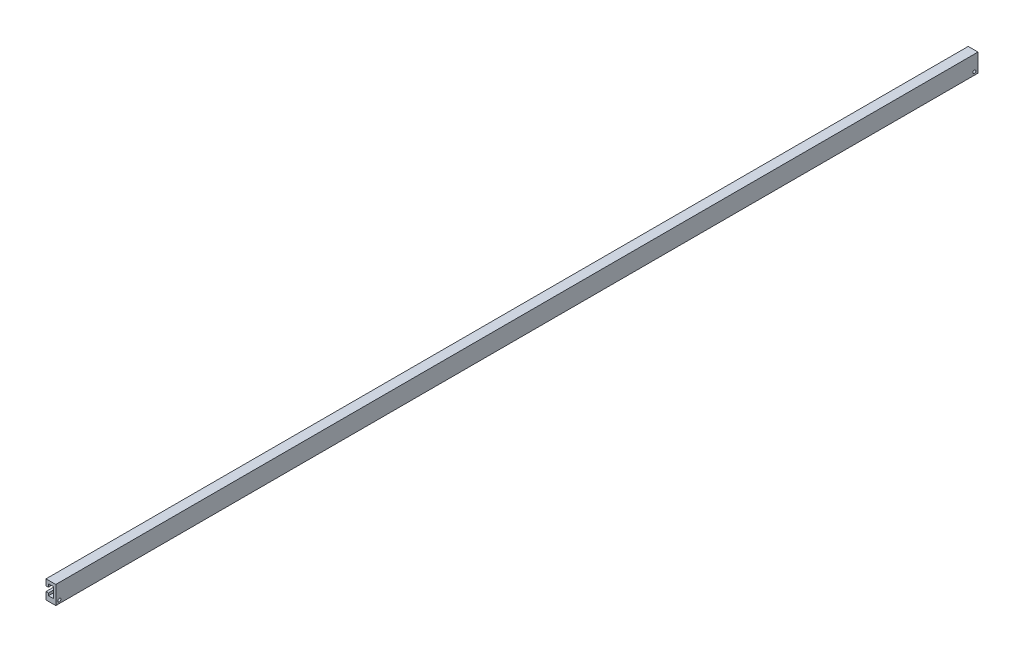
ISO-10303-21;
HEADER;
FILE_DESCRIPTION(('STEP AP214'),'2;1');
FILE_NAME('part.step','',(''),(''),'','','');
FILE_SCHEMA(('AUTOMOTIVE_DESIGN { 1 0 10303 214 1 1 1 1 }'));
ENDSEC;
DATA;
#1=APPLICATION_CONTEXT('core data for automotive mechanical design processes');
#2=APPLICATION_PROTOCOL_DEFINITION('international standard','automotive_design',2000,#1);
#3=PRODUCT_CONTEXT('',#1,'mechanical');
#4=PRODUCT('Part','Part','',(#3));
#5=PRODUCT_RELATED_PRODUCT_CATEGORY('part','',(#4));
#6=PRODUCT_DEFINITION_FORMATION('','',#4);
#7=PRODUCT_DEFINITION_CONTEXT('part definition',#1,'design');
#8=PRODUCT_DEFINITION('design','',#6,#7);
#9=PRODUCT_DEFINITION_SHAPE('','',#8);
#10=(LENGTH_UNIT() NAMED_UNIT(*) SI_UNIT(.MILLI.,.METRE.));
#11=(NAMED_UNIT(*) PLANE_ANGLE_UNIT() SI_UNIT($,.RADIAN.));
#12=(NAMED_UNIT(*) SI_UNIT($,.STERADIAN.) SOLID_ANGLE_UNIT());
#13=UNCERTAINTY_MEASURE_WITH_UNIT(LENGTH_MEASURE(1.E-05),#10,'distance_accuracy_value','');
#14=(GEOMETRIC_REPRESENTATION_CONTEXT(3) GLOBAL_UNCERTAINTY_ASSIGNED_CONTEXT((#13)) GLOBAL_UNIT_ASSIGNED_CONTEXT((#10,
#11,#12)) REPRESENTATION_CONTEXT('',''));
#15=CARTESIAN_POINT('',(0.,0.,0.));
#16=DIRECTION('',(0.,0.,1.));
#17=DIRECTION('',(1.,0.,0.));
#18=AXIS2_PLACEMENT_3D('',#15,#16,#17);
#19=CARTESIAN_POINT('',(6.29532043965097,4.74043168257957,755.));
#20=DIRECTION('',(0.,-1.,0.));
#21=DIRECTION('',(1.,0.,0.));
#22=AXIS2_PLACEMENT_3D('',#19,#20,#21);
#23=PLANE('',#22);
#24=DIRECTION('',(-1.,0.,0.));
#25=VECTOR('',#24,1.);
#26=CARTESIAN_POINT('',(0.,4.74043168257956,5.));
#27=LINE('',#26,#25);
#28=CARTESIAN_POINT('',(6.29532043965097,4.74043168257957,5.));
#29=VERTEX_POINT('',#28);
#30=CARTESIAN_POINT('',(2.29532043965097,4.74043168257957,5.));
#31=VERTEX_POINT('',#30);
#32=EDGE_CURVE('E494',#29,#31,#27,.T.);
#33=ORIENTED_EDGE('',*,*,#32,.T.);
#34=DIRECTION('',(0.,0.,-1.));
#35=VECTOR('',#34,1.);
#36=CARTESIAN_POINT('',(2.29532043965097,4.74043168257957,755.));
#37=LINE('',#36,#35);
#38=CARTESIAN_POINT('',(2.29532043965097,4.74043168257957,750.));
#39=VERTEX_POINT('',#38);
#40=EDGE_CURVE('E371',#39,#31,#37,.T.);
#41=ORIENTED_EDGE('',*,*,#40,.F.);
#42=DIRECTION('',(-1.,0.,0.));
#43=VECTOR('',#42,1.);
#44=CARTESIAN_POINT('',(0.,4.74043168257956,750.));
#45=LINE('',#44,#43);
#46=CARTESIAN_POINT('',(6.29532043965097,4.74043168257957,750.));
#47=VERTEX_POINT('',#46);
#48=EDGE_CURVE('E234',#47,#39,#45,.T.);
#49=ORIENTED_EDGE('',*,*,#48,.F.);
#50=DIRECTION('',(0.,0.,-1.));
#51=VECTOR('',#50,1.);
#52=CARTESIAN_POINT('',(6.29532043965097,4.74043168257957,755.));
#53=LINE('',#52,#51);
#54=EDGE_CURVE('E246',#47,#29,#53,.T.);
#55=ORIENTED_EDGE('',*,*,#54,.T.);
#56=EDGE_LOOP('',(#33,#41,#49,#55));
#57=FACE_BOUND('',#56,.T.);
#58=ADVANCED_FACE('F39',(#57),#23,.F.);
#59=CARTESIAN_POINT('',(6.29532043965097,8.24043168257957,755.));
#60=DIRECTION('',(1.,0.,0.));
#61=DIRECTION('',(0.,0.,-1.));
#62=AXIS2_PLACEMENT_3D('',#59,#60,#61);
#63=PLANE('',#62);
#64=DIRECTION('',(0.,0.,-1.));
#65=VECTOR('',#64,1.);
#66=CARTESIAN_POINT('',(6.29532043965097,6.24043168257957,5.));
#67=LINE('',#66,#65);
#68=CARTESIAN_POINT('',(6.29532043965097,6.24043168257957,5.));
#69=VERTEX_POINT('',#68);
#70=CARTESIAN_POINT('',(6.29532043965097,6.24043168257957,0.));
#71=VERTEX_POINT('',#70);
#72=EDGE_CURVE('E490',#69,#71,#67,.T.);
#73=ORIENTED_EDGE('',*,*,#72,.F.);
#74=DIRECTION('',(0.,-1.,0.));
#75=VECTOR('',#74,1.);
#76=CARTESIAN_POINT('',(6.29532043965097,0.,5.));
#77=LINE('',#76,#75);
#78=EDGE_CURVE('E491',#69,#29,#77,.T.);
#79=ORIENTED_EDGE('',*,*,#78,.T.);
#80=ORIENTED_EDGE('',*,*,#54,.F.);
#81=DIRECTION('',(0.,-1.,0.));
#82=VECTOR('',#81,1.);
#83=CARTESIAN_POINT('',(6.29532043965097,0.,750.));
#84=LINE('',#83,#82);
#85=CARTESIAN_POINT('',(6.29532043965097,6.24043168257957,750.));
#86=VERTEX_POINT('',#85);
#87=EDGE_CURVE('E238',#86,#47,#84,.T.);
#88=ORIENTED_EDGE('',*,*,#87,.F.);
#89=DIRECTION('',(0.,0.,1.));
#90=VECTOR('',#89,1.);
#91=CARTESIAN_POINT('',(6.29532043965097,6.24043168257957,750.));
#92=LINE('',#91,#90);
#93=CARTESIAN_POINT('',(6.29532043965097,6.24043168257957,755.));
#94=VERTEX_POINT('',#93);
#95=EDGE_CURVE('E222',#86,#94,#92,.T.);
#96=ORIENTED_EDGE('',*,*,#95,.T.);
#97=DIRECTION('',(0.,-1.,0.));
#98=VECTOR('',#97,1.);
#99=CARTESIAN_POINT('',(6.29532043965097,12.2404316825796,755.));
#100=LINE('',#99,#98);
#101=CARTESIAN_POINT('',(6.29532043965097,14.7404316825796,755.));
#102=VERTEX_POINT('',#101);
#103=EDGE_CURVE('E335',#102,#94,#100,.T.);
#104=ORIENTED_EDGE('',*,*,#103,.F.);
#105=DIRECTION('',(0.,0.,-1.));
#106=VECTOR('',#105,1.);
#107=CARTESIAN_POINT('',(6.29532043965097,14.7404316825796,755.));
#108=LINE('',#107,#106);
#109=CARTESIAN_POINT('',(6.29532043965097,14.7404316825796,0.));
#110=VERTEX_POINT('',#109);
#111=EDGE_CURVE('E375',#102,#110,#108,.T.);
#112=ORIENTED_EDGE('',*,*,#111,.T.);
#113=DIRECTION('',(0.,-1.,0.));
#114=VECTOR('',#113,1.);
#115=CARTESIAN_POINT('',(6.29532043965097,8.24043168257957,0.));
#116=LINE('',#115,#114);
#117=EDGE_CURVE('E361',#110,#71,#116,.T.);
#118=ORIENTED_EDGE('',*,*,#117,.T.);
#119=EDGE_LOOP('',(#73,#79,#80,#88,#96,#104,#112,#118));
#120=FACE_BOUND('',#119,.T.);
#121=ADVANCED_FACE('F244',(#120),#63,.F.);
#122=CARTESIAN_POINT('',(2.29532043965097,8.24043168257957,755.));
#123=DIRECTION('',(-1.,0.,0.));
#124=DIRECTION('',(0.,0.,1.));
#125=AXIS2_PLACEMENT_3D('',#122,#123,#124);
#126=PLANE('',#125);
#127=DIRECTION('',(0.,0.,-1.));
#128=VECTOR('',#127,1.);
#129=CARTESIAN_POINT('',(2.29532043965097,6.24043168257957,5.));
#130=LINE('',#129,#128);
#131=CARTESIAN_POINT('',(2.29532043965097,6.24043168257957,5.));
#132=VERTEX_POINT('',#131);
#133=CARTESIAN_POINT('',(2.29532043965097,6.24043168257957,0.));
#134=VERTEX_POINT('',#133);
#135=EDGE_CURVE('E489',#132,#134,#130,.T.);
#136=ORIENTED_EDGE('',*,*,#135,.T.);
#137=DIRECTION('',(0.,1.,0.));
#138=VECTOR('',#137,1.);
#139=CARTESIAN_POINT('',(2.29532043965097,8.24043168257957,0.));
#140=LINE('',#139,#138);
#141=CARTESIAN_POINT('',(2.29532043965097,8.24043168257957,0.));
#142=VERTEX_POINT('',#141);
#143=EDGE_CURVE('E363',#134,#142,#140,.T.);
#144=ORIENTED_EDGE('',*,*,#143,.T.);
#145=DIRECTION('',(0.,0.,-1.));
#146=VECTOR('',#145,1.);
#147=CARTESIAN_POINT('',(2.29532043965097,8.24043168257957,755.));
#148=LINE('',#147,#146);
#149=CARTESIAN_POINT('',(2.29532043965097,8.24043168257957,755.));
#150=VERTEX_POINT('',#149);
#151=EDGE_CURVE('E368',#150,#142,#148,.T.);
#152=ORIENTED_EDGE('',*,*,#151,.F.);
#153=DIRECTION('',(0.,1.,0.));
#154=VECTOR('',#153,1.);
#155=CARTESIAN_POINT('',(2.29532043965097,8.24043168257957,755.));
#156=LINE('',#155,#154);
#157=CARTESIAN_POINT('',(2.29532043965097,6.24043168257957,755.));
#158=VERTEX_POINT('',#157);
#159=EDGE_CURVE('E337',#158,#150,#156,.T.);
#160=ORIENTED_EDGE('',*,*,#159,.F.);
#161=DIRECTION('',(0.,0.,1.));
#162=VECTOR('',#161,1.);
#163=CARTESIAN_POINT('',(2.29532043965097,6.24043168257957,750.));
#164=LINE('',#163,#162);
#165=CARTESIAN_POINT('',(2.29532043965097,6.24043168257957,750.));
#166=VERTEX_POINT('',#165);
#167=EDGE_CURVE('E233',#166,#158,#164,.T.);
#168=ORIENTED_EDGE('',*,*,#167,.F.);
#169=DIRECTION('',(0.,1.,0.));
#170=VECTOR('',#169,1.);
#171=CARTESIAN_POINT('',(2.29532043965097,0.,750.));
#172=LINE('',#171,#170);
#173=EDGE_CURVE('E241',#39,#166,#172,.T.);
#174=ORIENTED_EDGE('',*,*,#173,.F.);
#175=ORIENTED_EDGE('',*,*,#40,.T.);
#176=DIRECTION('',(0.,1.,0.));
#177=VECTOR('',#176,1.);
#178=CARTESIAN_POINT('',(2.29532043965097,0.,5.));
#179=LINE('',#178,#177);
#180=EDGE_CURVE('E504',#31,#132,#179,.T.);
#181=ORIENTED_EDGE('',*,*,#180,.T.);
#182=EDGE_LOOP('',(#136,#144,#152,#160,#168,#174,#175,#181));
#183=FACE_BOUND('',#182,.T.);
#184=ADVANCED_FACE('F544',(#183),#126,.F.);
#185=CARTESIAN_POINT('',(0.295320439650968,2.24043168257957,755.));
#186=DIRECTION('',(1.,0.,0.));
#187=DIRECTION('',(0.,0.,-1.));
#188=AXIS2_PLACEMENT_3D('',#185,#186,#187);
#189=PLANE('',#188);
#190=CARTESIAN_POINT('',(0.295320439650968,4.74043168257957,3.));
#191=DIRECTION('',(1.,0.,0.));
#192=DIRECTION('',(0.,0.,-1.));
#193=AXIS2_PLACEMENT_3D('',#190,#191,#192);
#194=CIRCLE('',#193,1.24999999999999);
#195=CARTESIAN_POINT('',(0.295320439650968,4.74043168257957,1.75000000000001));
#196=VERTEX_POINT('',#195);
#197=EDGE_CURVE('E492',#196,#196,#194,.T.);
#198=ORIENTED_EDGE('',*,*,#197,.T.);
#199=EDGE_LOOP('',(#198));
#200=FACE_BOUND('',#199,.T.);
#201=CARTESIAN_POINT('',(0.295320439650968,4.74043168257957,752.));
#202=DIRECTION('',(1.,0.,0.));
#203=DIRECTION('',(0.,0.,-1.));
#204=AXIS2_PLACEMENT_3D('',#201,#202,#203);
#205=CIRCLE('',#204,1.24999999999999);
#206=CARTESIAN_POINT('',(0.295320439650968,4.74043168257957,750.75));
#207=VERTEX_POINT('',#206);
#208=EDGE_CURVE('E248',#207,#207,#205,.T.);
#209=ORIENTED_EDGE('',*,*,#208,.T.);
#210=EDGE_LOOP('',(#209));
#211=FACE_BOUND('',#210,.T.);
#212=DIRECTION('',(0.,0.,-1.));
#213=VECTOR('',#212,1.);
#214=CARTESIAN_POINT('',(0.295320439650968,2.24043168257957,755.));
#215=LINE('',#214,#213);
#216=CARTESIAN_POINT('',(0.295320439650968,2.24043168257957,51.5000000453384));
#217=VERTEX_POINT('',#216);
#218=CARTESIAN_POINT('',(0.295320439650968,2.24043168257957,0.));
#219=VERTEX_POINT('',#218);
#220=EDGE_CURVE('E396',#217,#219,#215,.T.);
#221=ORIENTED_EDGE('',*,*,#220,.F.);
#222=DIRECTION('',(0.,-1.,0.));
#223=VECTOR('',#222,1.);
#224=CARTESIAN_POINT('',(0.295320439650968,2.24043168257957,51.5000000453384));
#225=LINE('',#224,#223);
#226=CARTESIAN_POINT('',(0.295320439651026,4.24043168257956,51.5000000453383));
#227=VERTEX_POINT('',#226);
#228=EDGE_CURVE('E417',#217,#227,#225,.F.);
#229=ORIENTED_EDGE('',*,*,#228,.T.);
#230=DIRECTION('',(0.,0.,1.));
#231=VECTOR('',#230,1.);
#232=CARTESIAN_POINT('',(0.295320439651026,4.24043168257956,79.5000000453386));
#233=LINE('',#232,#231);
#234=CARTESIAN_POINT('',(0.295320439651026,4.24043168257956,87.5000000453386));
#235=VERTEX_POINT('',#234);
#236=EDGE_CURVE('E54',#227,#235,#233,.T.);
#237=ORIENTED_EDGE('',*,*,#236,.T.);
#238=DIRECTION('',(0.,-1.,0.));
#239=VECTOR('',#238,1.);
#240=CARTESIAN_POINT('',(0.295320439650968,2.24043168257957,87.5000000453386));
#241=LINE('',#240,#239);
#242=CARTESIAN_POINT('',(0.295320439650968,2.24043168257957,87.5000000453386));
#243=VERTEX_POINT('',#242);
#244=EDGE_CURVE('E415',#235,#243,#241,.T.);
#245=ORIENTED_EDGE('',*,*,#244,.T.);
#246=CARTESIAN_POINT('',(0.295320439650968,2.24043168257957,381.500000045339));
#247=VERTEX_POINT('',#246);
#248=EDGE_CURVE('E462',#247,#243,#215,.T.);
#249=ORIENTED_EDGE('',*,*,#248,.F.);
#250=DIRECTION('',(0.,-1.,0.));
#251=VECTOR('',#250,1.);
#252=CARTESIAN_POINT('',(0.295320439650968,2.24043168257957,381.500000045339));
#253=LINE('',#252,#251);
#254=CARTESIAN_POINT('',(0.29532043965097,4.24043168257956,381.500000045339));
#255=VERTEX_POINT('',#254);
#256=EDGE_CURVE('E409',#247,#255,#253,.F.);
#257=ORIENTED_EDGE('',*,*,#256,.T.);
#258=DIRECTION('',(0.,0.,1.));
#259=VECTOR('',#258,1.);
#260=CARTESIAN_POINT('',(0.29532043965097,4.24043168257956,409.500000045339));
#261=LINE('',#260,#259);
#262=CARTESIAN_POINT('',(0.29532043965097,4.24043168257956,417.500000045339));
#263=VERTEX_POINT('',#262);
#264=EDGE_CURVE('E306',#255,#263,#261,.T.);
#265=ORIENTED_EDGE('',*,*,#264,.T.);
#266=DIRECTION('',(0.,-1.,0.));
#267=VECTOR('',#266,1.);
#268=CARTESIAN_POINT('',(0.295320439650968,2.24043168257957,417.500000045339));
#269=LINE('',#268,#267);
#270=CARTESIAN_POINT('',(0.295320439650968,2.24043168257957,417.500000045339));
#271=VERTEX_POINT('',#270);
#272=EDGE_CURVE('E412',#263,#271,#269,.T.);
#273=ORIENTED_EDGE('',*,*,#272,.T.);
#274=CARTESIAN_POINT('',(0.295320439650968,2.24043168257957,671.500000045338));
#275=VERTEX_POINT('',#274);
#276=EDGE_CURVE('E401',#275,#271,#215,.T.);
#277=ORIENTED_EDGE('',*,*,#276,.F.);
#278=DIRECTION('',(0.,-1.,0.));
#279=VECTOR('',#278,1.);
#280=CARTESIAN_POINT('',(0.295320439650968,2.24043168257957,671.500000045338));
#281=LINE('',#280,#279);
#282=CARTESIAN_POINT('',(0.29532043965097,4.24043168257956,671.500000045338));
#283=VERTEX_POINT('',#282);
#284=EDGE_CURVE('E406',#275,#283,#281,.F.);
#285=ORIENTED_EDGE('',*,*,#284,.T.);
#286=DIRECTION('',(0.,0.,1.));
#287=VECTOR('',#286,1.);
#288=CARTESIAN_POINT('',(0.29532043965097,4.24043168257956,699.500000045338));
#289=LINE('',#288,#287);
#290=CARTESIAN_POINT('',(0.29532043965097,4.24043168257956,707.500000045338));
#291=VERTEX_POINT('',#290);
#292=EDGE_CURVE('E267',#283,#291,#289,.T.);
#293=ORIENTED_EDGE('',*,*,#292,.T.);
#294=DIRECTION('',(0.,-1.,0.));
#295=VECTOR('',#294,1.);
#296=CARTESIAN_POINT('',(0.295320439650968,2.24043168257957,707.500000045338));
#297=LINE('',#296,#295);
#298=CARTESIAN_POINT('',(0.295320439650968,2.24043168257957,707.500000045338));
#299=VERTEX_POINT('',#298);
#300=EDGE_CURVE('E400',#291,#299,#297,.T.);
#301=ORIENTED_EDGE('',*,*,#300,.T.);
#302=CARTESIAN_POINT('',(0.295320439650968,2.24043168257957,755.));
#303=VERTEX_POINT('',#302);
#304=EDGE_CURVE('E397',#303,#299,#215,.T.);
#305=ORIENTED_EDGE('',*,*,#304,.F.);
#306=DIRECTION('',(0.,-1.,0.));
#307=VECTOR('',#306,1.);
#308=CARTESIAN_POINT('',(0.295320439650968,2.24043168257957,755.));
#309=LINE('',#308,#307);
#310=CARTESIAN_POINT('',(0.295320439650968,8.24043168257957,755.));
#311=VERTEX_POINT('',#310);
#312=EDGE_CURVE('E317',#311,#303,#309,.T.);
#313=ORIENTED_EDGE('',*,*,#312,.F.);
#314=DIRECTION('',(0.,0.,-1.));
#315=VECTOR('',#314,1.);
#316=CARTESIAN_POINT('',(0.295320439650968,8.24043168257957,755.));
#317=LINE('',#316,#315);
#318=CARTESIAN_POINT('',(0.295320439650968,8.24043168257957,0.));
#319=VERTEX_POINT('',#318);
#320=EDGE_CURVE('E341',#311,#319,#317,.T.);
#321=ORIENTED_EDGE('',*,*,#320,.T.);
#322=DIRECTION('',(0.,-1.,0.));
#323=VECTOR('',#322,1.);
#324=CARTESIAN_POINT('',(0.295320439650968,2.24043168257957,0.));
#325=LINE('',#324,#323);
#326=EDGE_CURVE('E314',#319,#219,#325,.T.);
#327=ORIENTED_EDGE('',*,*,#326,.T.);
#328=EDGE_LOOP('',(#221,#229,#237,#245,#249,#257,#265,#273,#277,#285,#293,#301,#305,#313,#321,#327));
#329=FACE_BOUND('',#328,.T.);
#330=ADVANCED_FACE('F460',(#200,#211,#329),#189,.F.);
#331=CARTESIAN_POINT('',(0.295320439650968,2.24043168257957,755.));
#332=DIRECTION('',(0.,1.,0.));
#333=DIRECTION('',(0.,0.,1.));
#334=AXIS2_PLACEMENT_3D('',#331,#332,#333);
#335=PLANE('',#334);
#336=DIRECTION('',(1.,0.,0.));
#337=VECTOR('',#336,1.);
#338=CARTESIAN_POINT('',(0.295320439650968,2.24043168257957,0.));
#339=LINE('',#338,#337);
#340=CARTESIAN_POINT('',(8.29532043965097,2.24043168257957,0.));
#341=VERTEX_POINT('',#340);
#342=EDGE_CURVE('E344',#219,#341,#339,.T.);
#343=ORIENTED_EDGE('',*,*,#342,.T.);
#344=DIRECTION('',(0.,0.,-1.));
#345=VECTOR('',#344,1.);
#346=CARTESIAN_POINT('',(8.29532043965097,2.24043168257957,755.));
#347=LINE('',#346,#345);
#348=CARTESIAN_POINT('',(8.29532043965097,2.24043168257957,755.));
#349=VERTEX_POINT('',#348);
#350=EDGE_CURVE('E393',#349,#341,#347,.T.);
#351=ORIENTED_EDGE('',*,*,#350,.F.);
#352=DIRECTION('',(1.,0.,0.));
#353=VECTOR('',#352,1.);
#354=CARTESIAN_POINT('',(0.295320439650968,2.24043168257957,755.));
#355=LINE('',#354,#353);
#356=EDGE_CURVE('E320',#303,#349,#355,.T.);
#357=ORIENTED_EDGE('',*,*,#356,.F.);
#358=ORIENTED_EDGE('',*,*,#304,.T.);
#359=CARTESIAN_POINT('',(-7.70467956034903,2.24043168257957,707.500000045338));
#360=DIRECTION('',(0.,1.,0.));
#361=DIRECTION('',(0.,0.,1.));
#362=AXIS2_PLACEMENT_3D('',#359,#360,#361);
#363=CIRCLE('',#362,8.);
#364=CARTESIAN_POINT('',(-7.70467956034903,2.24043168257957,699.500000045338));
#365=VERTEX_POINT('',#364);
#366=EDGE_CURVE('E47',#299,#365,#363,.T.);
#367=ORIENTED_EDGE('',*,*,#366,.T.);
#368=DIRECTION('',(0.,0.,-1.));
#369=VECTOR('',#368,1.);
#370=CARTESIAN_POINT('',(-7.70467956034903,2.24043168257957,679.500000045338));
#371=LINE('',#370,#369);
#372=CARTESIAN_POINT('',(-7.70467956034903,2.24043168257957,679.500000045338));
#373=VERTEX_POINT('',#372);
#374=EDGE_CURVE('E261',#365,#373,#371,.T.);
#375=ORIENTED_EDGE('',*,*,#374,.T.);
#376=CARTESIAN_POINT('',(-7.70467956034903,2.24043168257957,671.500000045338));
#377=DIRECTION('',(0.,1.,0.));
#378=DIRECTION('',(0.,0.,1.));
#379=AXIS2_PLACEMENT_3D('',#376,#377,#378);
#380=CIRCLE('',#379,8.);
#381=EDGE_CURVE('E436',#373,#275,#380,.T.);
#382=ORIENTED_EDGE('',*,*,#381,.T.);
#383=ORIENTED_EDGE('',*,*,#276,.T.);
#384=CARTESIAN_POINT('',(-7.70467956034903,2.24043168257957,417.500000045339));
#385=DIRECTION('',(0.,1.,0.));
#386=DIRECTION('',(0.,0.,1.));
#387=AXIS2_PLACEMENT_3D('',#384,#385,#386);
#388=CIRCLE('',#387,8.);
#389=CARTESIAN_POINT('',(-7.70467956034903,2.24043168257957,409.500000045339));
#390=VERTEX_POINT('',#389);
#391=EDGE_CURVE('E427',#271,#390,#388,.T.);
#392=ORIENTED_EDGE('',*,*,#391,.T.);
#393=DIRECTION('',(0.,0.,-1.));
#394=VECTOR('',#393,1.);
#395=CARTESIAN_POINT('',(-7.70467956034903,2.24043168257957,389.500000045339));
#396=LINE('',#395,#394);
#397=CARTESIAN_POINT('',(-7.70467956034903,2.24043168257957,389.500000045339));
#398=VERTEX_POINT('',#397);
#399=EDGE_CURVE('E300',#390,#398,#396,.T.);
#400=ORIENTED_EDGE('',*,*,#399,.T.);
#401=CARTESIAN_POINT('',(-7.70467956034903,2.24043168257957,381.500000045339));
#402=DIRECTION('',(0.,1.,0.));
#403=DIRECTION('',(0.,0.,1.));
#404=AXIS2_PLACEMENT_3D('',#401,#402,#403);
#405=CIRCLE('',#404,8.);
#406=EDGE_CURVE('E432',#398,#247,#405,.T.);
#407=ORIENTED_EDGE('',*,*,#406,.T.);
#408=ORIENTED_EDGE('',*,*,#248,.T.);
#409=CARTESIAN_POINT('',(-7.70467956034903,2.24043168257957,87.5000000453386));
#410=DIRECTION('',(0.,1.,0.));
#411=DIRECTION('',(0.,0.,1.));
#412=AXIS2_PLACEMENT_3D('',#409,#410,#411);
#413=CIRCLE('',#412,8.);
#414=CARTESIAN_POINT('',(-7.70467956034898,2.24043168257957,79.5000000453386));
#415=VERTEX_POINT('',#414);
#416=EDGE_CURVE('E423',#243,#415,#413,.T.);
#417=ORIENTED_EDGE('',*,*,#416,.T.);
#418=DIRECTION('',(0.,0.,-1.));
#419=VECTOR('',#418,1.);
#420=CARTESIAN_POINT('',(-7.70467956034898,2.24043168257957,59.5000000453383));
#421=LINE('',#420,#419);
#422=CARTESIAN_POINT('',(-7.70467956034898,2.24043168257957,59.5000000453383));
#423=VERTEX_POINT('',#422);
#424=EDGE_CURVE('E281',#415,#423,#421,.T.);
#425=ORIENTED_EDGE('',*,*,#424,.T.);
#426=CARTESIAN_POINT('',(-7.70467956034903,2.24043168257957,51.5000000453383));
#427=DIRECTION('',(0.,1.,0.));
#428=DIRECTION('',(0.,0.,1.));
#429=AXIS2_PLACEMENT_3D('',#426,#427,#428);
#430=CIRCLE('',#429,8.);
#431=EDGE_CURVE('E419',#423,#217,#430,.T.);
#432=ORIENTED_EDGE('',*,*,#431,.T.);
#433=ORIENTED_EDGE('',*,*,#220,.T.);
#434=EDGE_LOOP('',(#343,#351,#357,#358,#367,#375,#382,#383,#392,#400,#407,#408,#417,#425,#432,#433));
#435=FACE_BOUND('',#434,.T.);
#436=CARTESIAN_POINT('',(-3.70467956034897,2.24043168257957,399.500000045339));
#437=DIRECTION('',(0.,-1.,0.));
#438=DIRECTION('',(0.,0.,-1.));
#439=AXIS2_PLACEMENT_3D('',#436,#437,#438);
#440=CIRCLE('',#439,1.5);
#441=CARTESIAN_POINT('',(-3.70467956034897,2.24043168257957,398.000000045339));
#442=VERTEX_POINT('',#441);
#443=EDGE_CURVE('E294',#442,#442,#440,.T.);
#444=ORIENTED_EDGE('',*,*,#443,.F.);
#445=EDGE_LOOP('',(#444));
#446=FACE_BOUND('',#445,.T.);
#447=CARTESIAN_POINT('',(-3.70467956034895,2.24043168257957,69.5000000453385));
#448=DIRECTION('',(0.,-1.,0.));
#449=DIRECTION('',(0.,0.,-1.));
#450=AXIS2_PLACEMENT_3D('',#447,#448,#449);
#451=CIRCLE('',#450,1.5);
#452=CARTESIAN_POINT('',(-3.70467956034895,2.24043168257957,68.0000000453385));
#453=VERTEX_POINT('',#452);
#454=EDGE_CURVE('E275',#453,#453,#451,.T.);
#455=ORIENTED_EDGE('',*,*,#454,.F.);
#456=EDGE_LOOP('',(#455));
#457=FACE_BOUND('',#456,.T.);
#458=CARTESIAN_POINT('',(-3.70467956034897,2.24043168257957,689.500000045338));
#459=DIRECTION('',(0.,-1.,0.));
#460=DIRECTION('',(0.,0.,-1.));
#461=AXIS2_PLACEMENT_3D('',#458,#459,#460);
#462=CIRCLE('',#461,1.5);
#463=CARTESIAN_POINT('',(-3.70467956034897,2.24043168257957,688.000000045338));
#464=VERTEX_POINT('',#463);
#465=EDGE_CURVE('E256',#464,#464,#462,.T.);
#466=ORIENTED_EDGE('',*,*,#465,.F.);
#467=EDGE_LOOP('',(#466));
#468=FACE_BOUND('',#467,.T.);
#469=ADVANCED_FACE('F441',(#435,#446,#457,#468),#335,.F.);
#470=CARTESIAN_POINT('',(8.29532043965097,17.2404316825796,755.));
#471=DIRECTION('',(-1.,0.,0.));
#472=DIRECTION('',(0.,0.,1.));
#473=AXIS2_PLACEMENT_3D('',#470,#471,#472);
#474=PLANE('',#473);
#475=CARTESIAN_POINT('',(8.29532043965097,4.74043168257957,3.));
#476=DIRECTION('',(1.,0.,0.));
#477=DIRECTION('',(0.,0.,-1.));
#478=AXIS2_PLACEMENT_3D('',#475,#476,#477);
#479=CIRCLE('',#478,1.24999999999999);
#480=CARTESIAN_POINT('',(8.29532043965097,4.74043168257957,1.75000000000002));
#481=VERTEX_POINT('',#480);
#482=EDGE_CURVE('E497',#481,#481,#479,.T.);
#483=ORIENTED_EDGE('',*,*,#482,.F.);
#484=EDGE_LOOP('',(#483));
#485=FACE_BOUND('',#484,.T.);
#486=CARTESIAN_POINT('',(8.29532043965097,4.74043168257957,752.));
#487=DIRECTION('',(1.,0.,0.));
#488=DIRECTION('',(0.,0.,-1.));
#489=AXIS2_PLACEMENT_3D('',#486,#487,#488);
#490=CIRCLE('',#489,1.24999999999999);
#491=CARTESIAN_POINT('',(8.29532043965097,4.74043168257957,750.75));
#492=VERTEX_POINT('',#491);
#493=EDGE_CURVE('E251',#492,#492,#490,.T.);
#494=ORIENTED_EDGE('',*,*,#493,.F.);
#495=EDGE_LOOP('',(#494));
#496=FACE_BOUND('',#495,.T.);
#497=DIRECTION('',(0.,1.,0.));
#498=VECTOR('',#497,1.);
#499=CARTESIAN_POINT('',(8.29532043965097,17.2404316825796,0.));
#500=LINE('',#499,#498);
#501=CARTESIAN_POINT('',(8.29532043965097,17.2404316825796,0.));
#502=VERTEX_POINT('',#501);
#503=EDGE_CURVE('E347',#341,#502,#500,.T.);
#504=ORIENTED_EDGE('',*,*,#503,.T.);
#505=DIRECTION('',(0.,0.,-1.));
#506=VECTOR('',#505,1.);
#507=CARTESIAN_POINT('',(8.29532043965097,17.2404316825796,755.));
#508=LINE('',#507,#506);
#509=CARTESIAN_POINT('',(8.29532043965097,17.2404316825796,755.));
#510=VERTEX_POINT('',#509);
#511=EDGE_CURVE('E390',#510,#502,#508,.T.);
#512=ORIENTED_EDGE('',*,*,#511,.F.);
#513=DIRECTION('',(0.,1.,0.));
#514=VECTOR('',#513,1.);
#515=CARTESIAN_POINT('',(8.29532043965097,2.24043168257957,755.));
#516=LINE('',#515,#514);
#517=EDGE_CURVE('E323',#349,#510,#516,.T.);
#518=ORIENTED_EDGE('',*,*,#517,.F.);
#519=ORIENTED_EDGE('',*,*,#350,.T.);
#520=EDGE_LOOP('',(#504,#512,#518,#519));
#521=FACE_BOUND('',#520,.T.);
#522=ADVANCED_FACE('F516',(#485,#496,#521),#474,.F.);
#523=CARTESIAN_POINT('',(0.295320439650968,17.2404316825796,755.));
#524=DIRECTION('',(0.,-1.,0.));
#525=DIRECTION('',(0.,0.,-1.));
#526=AXIS2_PLACEMENT_3D('',#523,#524,#525);
#527=PLANE('',#526);
#528=DIRECTION('',(-1.,0.,0.));
#529=VECTOR('',#528,1.);
#530=CARTESIAN_POINT('',(0.295320439650968,17.2404316825796,0.));
#531=LINE('',#530,#529);
#532=CARTESIAN_POINT('',(0.295320439650968,17.2404316825796,0.));
#533=VERTEX_POINT('',#532);
#534=EDGE_CURVE('E349',#502,#533,#531,.T.);
#535=ORIENTED_EDGE('',*,*,#534,.T.);
#536=DIRECTION('',(0.,0.,-1.));
#537=VECTOR('',#536,1.);
#538=CARTESIAN_POINT('',(0.295320439650968,17.2404316825796,755.));
#539=LINE('',#538,#537);
#540=CARTESIAN_POINT('',(0.295320439650968,17.2404316825796,755.));
#541=VERTEX_POINT('',#540);
#542=EDGE_CURVE('E387',#541,#533,#539,.T.);
#543=ORIENTED_EDGE('',*,*,#542,.F.);
#544=DIRECTION('',(-1.,0.,0.));
#545=VECTOR('',#544,1.);
#546=CARTESIAN_POINT('',(0.295320439650968,17.2404316825796,755.));
#547=LINE('',#546,#545);
#548=EDGE_CURVE('E325',#510,#541,#547,.T.);
#549=ORIENTED_EDGE('',*,*,#548,.F.);
#550=ORIENTED_EDGE('',*,*,#511,.T.);
#551=EDGE_LOOP('',(#535,#543,#549,#550));
#552=FACE_BOUND('',#551,.T.);
#553=ADVANCED_FACE('F519',(#552),#527,.F.);
#554=CARTESIAN_POINT('',(0.295320439650968,14.7404316825796,755.));
#555=DIRECTION('',(1.,0.,0.));
#556=DIRECTION('',(0.,0.,-1.));
#557=AXIS2_PLACEMENT_3D('',#554,#555,#556);
#558=PLANE('',#557);
#559=DIRECTION('',(0.,-1.,0.));
#560=VECTOR('',#559,1.);
#561=CARTESIAN_POINT('',(0.295320439650968,14.7404316825796,0.));
#562=LINE('',#561,#560);
#563=CARTESIAN_POINT('',(0.295320439650968,12.2404316825796,0.));
#564=VERTEX_POINT('',#563);
#565=EDGE_CURVE('E352',#533,#564,#562,.T.);
#566=ORIENTED_EDGE('',*,*,#565,.T.);
#567=DIRECTION('',(0.,0.,-1.));
#568=VECTOR('',#567,1.);
#569=CARTESIAN_POINT('',(0.295320439650968,12.2404316825796,755.));
#570=LINE('',#569,#568);
#571=CARTESIAN_POINT('',(0.295320439650968,12.2404316825796,755.));
#572=VERTEX_POINT('',#571);
#573=EDGE_CURVE('E384',#572,#564,#570,.T.);
#574=ORIENTED_EDGE('',*,*,#573,.F.);
#575=DIRECTION('',(0.,-1.,0.));
#576=VECTOR('',#575,1.);
#577=CARTESIAN_POINT('',(0.295320439650968,17.2404316825796,755.));
#578=LINE('',#577,#576);
#579=EDGE_CURVE('E327',#541,#572,#578,.T.);
#580=ORIENTED_EDGE('',*,*,#579,.F.);
#581=ORIENTED_EDGE('',*,*,#542,.T.);
#582=EDGE_LOOP('',(#566,#574,#580,#581));
#583=FACE_BOUND('',#582,.T.);
#584=ADVANCED_FACE('F533',(#583),#558,.F.);
#585=CARTESIAN_POINT('',(0.295320439650968,12.2404316825796,755.));
#586=DIRECTION('',(0.,1.,0.));
#587=DIRECTION('',(0.,0.,1.));
#588=AXIS2_PLACEMENT_3D('',#585,#586,#587);
#589=PLANE('',#588);
#590=DIRECTION('',(1.,0.,0.));
#591=VECTOR('',#590,1.);
#592=CARTESIAN_POINT('',(0.295320439650968,12.2404316825796,0.));
#593=LINE('',#592,#591);
#594=CARTESIAN_POINT('',(2.29532043965097,12.2404316825796,0.));
#595=VERTEX_POINT('',#594);
#596=EDGE_CURVE('E354',#564,#595,#593,.T.);
#597=ORIENTED_EDGE('',*,*,#596,.T.);
#598=DIRECTION('',(0.,0.,-1.));
#599=VECTOR('',#598,1.);
#600=CARTESIAN_POINT('',(2.29532043965097,12.2404316825796,755.));
#601=LINE('',#600,#599);
#602=CARTESIAN_POINT('',(2.29532043965097,12.2404316825796,755.));
#603=VERTEX_POINT('',#602);
#604=EDGE_CURVE('E381',#603,#595,#601,.T.);
#605=ORIENTED_EDGE('',*,*,#604,.F.);
#606=DIRECTION('',(1.,0.,0.));
#607=VECTOR('',#606,1.);
#608=CARTESIAN_POINT('',(0.295320439650968,12.2404316825796,755.));
#609=LINE('',#608,#607);
#610=EDGE_CURVE('E329',#572,#603,#609,.T.);
#611=ORIENTED_EDGE('',*,*,#610,.F.);
#612=ORIENTED_EDGE('',*,*,#573,.T.);
#613=EDGE_LOOP('',(#597,#605,#611,#612));
#614=FACE_BOUND('',#613,.T.);
#615=ADVANCED_FACE('F537',(#614),#589,.F.);
#616=CARTESIAN_POINT('',(2.29532043965097,12.2404316825796,755.));
#617=DIRECTION('',(-1.,0.,0.));
#618=DIRECTION('',(0.,0.,1.));
#619=AXIS2_PLACEMENT_3D('',#616,#617,#618);
#620=PLANE('',#619);
#621=DIRECTION('',(0.,1.,0.));
#622=VECTOR('',#621,1.);
#623=CARTESIAN_POINT('',(2.29532043965097,12.2404316825796,0.));
#624=LINE('',#623,#622);
#625=CARTESIAN_POINT('',(2.29532043965097,14.7404316825796,0.));
#626=VERTEX_POINT('',#625);
#627=EDGE_CURVE('E356',#595,#626,#624,.T.);
#628=ORIENTED_EDGE('',*,*,#627,.T.);
#629=DIRECTION('',(0.,0.,-1.));
#630=VECTOR('',#629,1.);
#631=CARTESIAN_POINT('',(2.29532043965097,14.7404316825796,755.));
#632=LINE('',#631,#630);
#633=CARTESIAN_POINT('',(2.29532043965097,14.7404316825796,755.));
#634=VERTEX_POINT('',#633);
#635=EDGE_CURVE('E378',#634,#626,#632,.T.);
#636=ORIENTED_EDGE('',*,*,#635,.F.);
#637=DIRECTION('',(0.,1.,0.));
#638=VECTOR('',#637,1.);
#639=CARTESIAN_POINT('',(2.29532043965097,12.2404316825796,755.));
#640=LINE('',#639,#638);
#641=EDGE_CURVE('E331',#603,#634,#640,.T.);
#642=ORIENTED_EDGE('',*,*,#641,.F.);
#643=ORIENTED_EDGE('',*,*,#604,.T.);
#644=EDGE_LOOP('',(#628,#636,#642,#643));
#645=FACE_BOUND('',#644,.T.);
#646=ADVANCED_FACE('F564',(#645),#620,.F.);
#647=CARTESIAN_POINT('',(6.29532043965097,14.7404316825796,755.));
#648=DIRECTION('',(0.,1.,0.));
#649=DIRECTION('',(0.,0.,1.));
#650=AXIS2_PLACEMENT_3D('',#647,#648,#649);
#651=PLANE('',#650);
#652=DIRECTION('',(1.,0.,0.));
#653=VECTOR('',#652,1.);
#654=CARTESIAN_POINT('',(6.29532043965097,14.7404316825796,0.));
#655=LINE('',#654,#653);
#656=EDGE_CURVE('E358',#626,#110,#655,.T.);
#657=ORIENTED_EDGE('',*,*,#656,.T.);
#658=ORIENTED_EDGE('',*,*,#111,.F.);
#659=DIRECTION('',(1.,0.,0.));
#660=VECTOR('',#659,1.);
#661=CARTESIAN_POINT('',(6.29532043965097,14.7404316825796,755.));
#662=LINE('',#661,#660);
#663=EDGE_CURVE('E333',#634,#102,#662,.T.);
#664=ORIENTED_EDGE('',*,*,#663,.F.);
#665=ORIENTED_EDGE('',*,*,#635,.T.);
#666=EDGE_LOOP('',(#657,#658,#664,#665));
#667=FACE_BOUND('',#666,.T.);
#668=ADVANCED_FACE('F561',(#667),#651,.F.);
#669=CARTESIAN_POINT('',(0.295320439650968,8.24043168257957,755.));
#670=DIRECTION('',(0.,-1.,0.));
#671=DIRECTION('',(0.,0.,-1.));
#672=AXIS2_PLACEMENT_3D('',#669,#670,#671);
#673=PLANE('',#672);
#674=DIRECTION('',(-1.,0.,0.));
#675=VECTOR('',#674,1.);
#676=CARTESIAN_POINT('',(0.295320439650968,8.24043168257957,0.));
#677=LINE('',#676,#675);
#678=EDGE_CURVE('E321',#142,#319,#677,.T.);
#679=ORIENTED_EDGE('',*,*,#678,.T.);
#680=ORIENTED_EDGE('',*,*,#320,.F.);
#681=DIRECTION('',(-1.,0.,0.));
#682=VECTOR('',#681,1.);
#683=CARTESIAN_POINT('',(0.295320439650968,8.24043168257957,755.));
#684=LINE('',#683,#682);
#685=EDGE_CURVE('E339',#150,#311,#684,.T.);
#686=ORIENTED_EDGE('',*,*,#685,.F.);
#687=ORIENTED_EDGE('',*,*,#151,.T.);
#688=EDGE_LOOP('',(#679,#680,#686,#687));
#689=FACE_BOUND('',#688,.T.);
#690=ADVANCED_FACE('F478',(#689),#673,.F.);
#691=CARTESIAN_POINT('',(0.,0.,755.));
#692=DIRECTION('',(0.,0.,-1.));
#693=DIRECTION('',(-1.,0.,0.));
#694=AXIS2_PLACEMENT_3D('',#691,#692,#693);
#695=PLANE('',#694);
#696=ORIENTED_EDGE('',*,*,#312,.T.);
#697=ORIENTED_EDGE('',*,*,#356,.T.);
#698=ORIENTED_EDGE('',*,*,#517,.T.);
#699=ORIENTED_EDGE('',*,*,#548,.T.);
#700=ORIENTED_EDGE('',*,*,#579,.T.);
#701=ORIENTED_EDGE('',*,*,#610,.T.);
#702=ORIENTED_EDGE('',*,*,#641,.T.);
#703=ORIENTED_EDGE('',*,*,#663,.T.);
#704=ORIENTED_EDGE('',*,*,#103,.T.);
#705=DIRECTION('',(-1.,0.,0.));
#706=VECTOR('',#705,1.);
#707=CARTESIAN_POINT('',(0.,6.24043168257957,755.));
#708=LINE('',#707,#706);
#709=EDGE_CURVE('E228',#94,#158,#708,.T.);
#710=ORIENTED_EDGE('',*,*,#709,.T.);
#711=ORIENTED_EDGE('',*,*,#159,.T.);
#712=ORIENTED_EDGE('',*,*,#685,.T.);
#713=EDGE_LOOP('',(#696,#697,#698,#699,#700,#701,#702,#703,#704,#710,#711,#712));
#714=FACE_BOUND('',#713,.T.);
#715=ADVANCED_FACE('F541',(#714),#695,.F.);
#716=CARTESIAN_POINT('',(0.,0.,0.));
#717=DIRECTION('',(0.,0.,-1.));
#718=DIRECTION('',(-1.,0.,0.));
#719=AXIS2_PLACEMENT_3D('',#716,#717,#718);
#720=PLANE('',#719);
#721=ORIENTED_EDGE('',*,*,#143,.F.);
#722=DIRECTION('',(-1.,0.,0.));
#723=VECTOR('',#722,1.);
#724=CARTESIAN_POINT('',(0.,6.24043168257957,0.));
#725=LINE('',#724,#723);
#726=EDGE_CURVE('E482',#71,#134,#725,.T.);
#727=ORIENTED_EDGE('',*,*,#726,.F.);
#728=ORIENTED_EDGE('',*,*,#117,.F.);
#729=ORIENTED_EDGE('',*,*,#656,.F.);
#730=ORIENTED_EDGE('',*,*,#627,.F.);
#731=ORIENTED_EDGE('',*,*,#596,.F.);
#732=ORIENTED_EDGE('',*,*,#565,.F.);
#733=ORIENTED_EDGE('',*,*,#534,.F.);
#734=ORIENTED_EDGE('',*,*,#503,.F.);
#735=ORIENTED_EDGE('',*,*,#342,.F.);
#736=ORIENTED_EDGE('',*,*,#326,.F.);
#737=ORIENTED_EDGE('',*,*,#678,.F.);
#738=EDGE_LOOP('',(#721,#727,#728,#729,#730,#731,#732,#733,#734,#735,#736,#737));
#739=FACE_BOUND('',#738,.T.);
#740=ADVANCED_FACE('F471',(#739),#720,.T.);
#741=CARTESIAN_POINT('',(-7.70467956034903,4.24043168257956,389.500000045339));
#742=DIRECTION('',(-1.,0.,0.));
#743=DIRECTION('',(0.,0.,1.));
#744=AXIS2_PLACEMENT_3D('',#741,#742,#743);
#745=PLANE('',#744);
#746=ORIENTED_EDGE('',*,*,#399,.F.);
#747=DIRECTION('',(0.,-1.,0.));
#748=VECTOR('',#747,1.);
#749=CARTESIAN_POINT('',(-7.70467956034903,4.24043168257956,409.500000045339));
#750=LINE('',#749,#748);
#751=CARTESIAN_POINT('',(-7.70467956034903,4.24043168257956,409.500000045339));
#752=VERTEX_POINT('',#751);
#753=EDGE_CURVE('E311',#752,#390,#750,.T.);
#754=ORIENTED_EDGE('',*,*,#753,.F.);
#755=DIRECTION('',(0.,0.,-1.));
#756=VECTOR('',#755,1.);
#757=CARTESIAN_POINT('',(-7.70467956034903,4.24043168257956,389.500000045339));
#758=LINE('',#757,#756);
#759=CARTESIAN_POINT('',(-7.70467956034903,4.24043168257956,389.500000045339));
#760=VERTEX_POINT('',#759);
#761=EDGE_CURVE('E303',#752,#760,#758,.T.);
#762=ORIENTED_EDGE('',*,*,#761,.T.);
#763=DIRECTION('',(0.,-1.,0.));
#764=VECTOR('',#763,1.);
#765=CARTESIAN_POINT('',(-7.70467956034903,4.24043168257956,389.500000045339));
#766=LINE('',#765,#764);
#767=EDGE_CURVE('E308',#760,#398,#766,.T.);
#768=ORIENTED_EDGE('',*,*,#767,.T.);
#769=EDGE_LOOP('',(#746,#754,#762,#768));
#770=FACE_BOUND('',#769,.T.);
#771=ADVANCED_FACE('F684',(#770),#745,.T.);
#772=CARTESIAN_POINT('',(0.,4.24043168257956,0.));
#773=DIRECTION('',(0.,1.,0.));
#774=DIRECTION('',(0.,0.,1.));
#775=AXIS2_PLACEMENT_3D('',#772,#773,#774);
#776=PLANE('',#775);
#777=CARTESIAN_POINT('',(-3.70467956034897,4.24043168257956,399.500000045339));
#778=DIRECTION('',(0.,-1.,0.));
#779=DIRECTION('',(0.,0.,-1.));
#780=AXIS2_PLACEMENT_3D('',#777,#778,#779);
#781=CIRCLE('',#780,1.5);
#782=CARTESIAN_POINT('',(-3.70467956034897,4.24043168257956,398.000000045339));
#783=VERTEX_POINT('',#782);
#784=EDGE_CURVE('E297',#783,#783,#781,.T.);
#785=ORIENTED_EDGE('',*,*,#784,.T.);
#786=EDGE_LOOP('',(#785));
#787=FACE_BOUND('',#786,.T.);
#788=ORIENTED_EDGE('',*,*,#761,.F.);
#789=CARTESIAN_POINT('',(-7.70467956034903,4.24043168257956,417.500000045339));
#790=DIRECTION('',(0.,1.,0.));
#791=DIRECTION('',(0.,0.,1.));
#792=AXIS2_PLACEMENT_3D('',#789,#790,#791);
#793=CIRCLE('',#792,8.);
#794=EDGE_CURVE('E429',#752,#263,#793,.F.);
#795=ORIENTED_EDGE('',*,*,#794,.T.);
#796=ORIENTED_EDGE('',*,*,#264,.F.);
#797=CARTESIAN_POINT('',(-7.70467956034903,4.24043168257956,381.500000045339));
#798=DIRECTION('',(0.,1.,0.));
#799=DIRECTION('',(0.,0.,1.));
#800=AXIS2_PLACEMENT_3D('',#797,#798,#799);
#801=CIRCLE('',#800,8.);
#802=EDGE_CURVE('E434',#255,#760,#801,.F.);
#803=ORIENTED_EDGE('',*,*,#802,.T.);
#804=EDGE_LOOP('',(#788,#795,#796,#803));
#805=FACE_BOUND('',#804,.T.);
#806=ADVANCED_FACE('F679',(#787,#805),#776,.T.);
#807=CARTESIAN_POINT('',(-3.70467956034897,4.24043168257956,399.500000045339));
#808=DIRECTION('',(0.,-1.,0.));
#809=DIRECTION('',(0.,0.,-1.));
#810=AXIS2_PLACEMENT_3D('',#807,#808,#809);
#811=CYLINDRICAL_SURFACE('',#810,1.5);
#812=ORIENTED_EDGE('',*,*,#784,.F.);
#813=EDGE_LOOP('',(#812));
#814=FACE_BOUND('',#813,.T.);
#815=ORIENTED_EDGE('',*,*,#443,.T.);
#816=EDGE_LOOP('',(#815));
#817=FACE_BOUND('',#816,.T.);
#818=ADVANCED_FACE('F671',(#814,#817),#811,.F.);
#819=CARTESIAN_POINT('',(-7.70467956034898,4.24043168257956,59.5000000453383));
#820=DIRECTION('',(-1.,0.,0.));
#821=DIRECTION('',(0.,0.,1.));
#822=AXIS2_PLACEMENT_3D('',#819,#820,#821);
#823=PLANE('',#822);
#824=ORIENTED_EDGE('',*,*,#424,.F.);
#825=DIRECTION('',(0.,-1.,0.));
#826=VECTOR('',#825,1.);
#827=CARTESIAN_POINT('',(-7.70467956034898,4.24043168257956,79.5000000453386));
#828=LINE('',#827,#826);
#829=CARTESIAN_POINT('',(-7.70467956034898,4.24043168257956,79.5000000453386));
#830=VERTEX_POINT('',#829);
#831=EDGE_CURVE('E288',#830,#415,#828,.T.);
#832=ORIENTED_EDGE('',*,*,#831,.F.);
#833=DIRECTION('',(0.,0.,-1.));
#834=VECTOR('',#833,1.);
#835=CARTESIAN_POINT('',(-7.70467956034898,4.24043168257956,59.5000000453383));
#836=LINE('',#835,#834);
#837=CARTESIAN_POINT('',(-7.70467956034898,4.24043168257956,59.5000000453383));
#838=VERTEX_POINT('',#837);
#839=EDGE_CURVE('E284',#830,#838,#836,.T.);
#840=ORIENTED_EDGE('',*,*,#839,.T.);
#841=DIRECTION('',(0.,-1.,0.));
#842=VECTOR('',#841,1.);
#843=CARTESIAN_POINT('',(-7.70467956034898,4.24043168257956,59.5000000453383));
#844=LINE('',#843,#842);
#845=EDGE_CURVE('E291',#838,#423,#844,.T.);
#846=ORIENTED_EDGE('',*,*,#845,.T.);
#847=EDGE_LOOP('',(#824,#832,#840,#846));
#848=FACE_BOUND('',#847,.T.);
#849=ADVANCED_FACE('F661',(#848),#823,.T.);
#850=CARTESIAN_POINT('',(0.,4.24043168257956,0.));
#851=DIRECTION('',(0.,1.,0.));
#852=DIRECTION('',(0.,0.,1.));
#853=AXIS2_PLACEMENT_3D('',#850,#851,#852);
#854=PLANE('',#853);
#855=CARTESIAN_POINT('',(-3.70467956034895,4.24043168257956,69.5000000453385));
#856=DIRECTION('',(0.,-1.,0.));
#857=DIRECTION('',(0.,0.,-1.));
#858=AXIS2_PLACEMENT_3D('',#855,#856,#857);
#859=CIRCLE('',#858,1.5);
#860=CARTESIAN_POINT('',(-3.70467956034895,4.24043168257956,68.0000000453385));
#861=VERTEX_POINT('',#860);
#862=EDGE_CURVE('E278',#861,#861,#859,.T.);
#863=ORIENTED_EDGE('',*,*,#862,.T.);
#864=EDGE_LOOP('',(#863));
#865=FACE_BOUND('',#864,.T.);
#866=ORIENTED_EDGE('',*,*,#839,.F.);
#867=CARTESIAN_POINT('',(-7.70467956034903,4.24043168257956,87.5000000453386));
#868=DIRECTION('',(0.,1.,0.));
#869=DIRECTION('',(0.,0.,1.));
#870=AXIS2_PLACEMENT_3D('',#867,#868,#869);
#871=CIRCLE('',#870,8.);
#872=EDGE_CURVE('E425',#830,#235,#871,.F.);
#873=ORIENTED_EDGE('',*,*,#872,.T.);
#874=ORIENTED_EDGE('',*,*,#236,.F.);
#875=CARTESIAN_POINT('',(-7.70467956034903,4.24043168257956,51.5000000453383));
#876=DIRECTION('',(0.,1.,0.));
#877=DIRECTION('',(0.,0.,1.));
#878=AXIS2_PLACEMENT_3D('',#875,#876,#877);
#879=CIRCLE('',#878,8.);
#880=EDGE_CURVE('E421',#227,#838,#879,.F.);
#881=ORIENTED_EDGE('',*,*,#880,.T.);
#882=EDGE_LOOP('',(#866,#873,#874,#881));
#883=FACE_BOUND('',#882,.T.);
#884=ADVANCED_FACE('F656',(#865,#883),#854,.T.);
#885=CARTESIAN_POINT('',(-3.70467956034895,4.24043168257956,69.5000000453385));
#886=DIRECTION('',(0.,-1.,0.));
#887=DIRECTION('',(0.,0.,-1.));
#888=AXIS2_PLACEMENT_3D('',#885,#886,#887);
#889=CYLINDRICAL_SURFACE('',#888,1.5);
#890=ORIENTED_EDGE('',*,*,#862,.F.);
#891=EDGE_LOOP('',(#890));
#892=FACE_BOUND('',#891,.T.);
#893=ORIENTED_EDGE('',*,*,#454,.T.);
#894=EDGE_LOOP('',(#893));
#895=FACE_BOUND('',#894,.T.);
#896=ADVANCED_FACE('F649',(#892,#895),#889,.F.);
#897=CARTESIAN_POINT('',(-7.70467956034903,4.24043168257956,679.500000045338));
#898=DIRECTION('',(-1.,0.,0.));
#899=DIRECTION('',(0.,0.,1.));
#900=AXIS2_PLACEMENT_3D('',#897,#898,#899);
#901=PLANE('',#900);
#902=ORIENTED_EDGE('',*,*,#374,.F.);
#903=DIRECTION('',(0.,-1.,0.));
#904=VECTOR('',#903,1.);
#905=CARTESIAN_POINT('',(-7.70467956034903,4.24043168257956,699.500000045338));
#906=LINE('',#905,#904);
#907=CARTESIAN_POINT('',(-7.70467956034903,4.24043168257956,699.500000045338));
#908=VERTEX_POINT('',#907);
#909=EDGE_CURVE('E269',#908,#365,#906,.T.);
#910=ORIENTED_EDGE('',*,*,#909,.F.);
#911=DIRECTION('',(0.,0.,-1.));
#912=VECTOR('',#911,1.);
#913=CARTESIAN_POINT('',(-7.70467956034903,4.24043168257956,679.500000045338));
#914=LINE('',#913,#912);
#915=CARTESIAN_POINT('',(-7.70467956034903,4.24043168257956,679.500000045338));
#916=VERTEX_POINT('',#915);
#917=EDGE_CURVE('E264',#908,#916,#914,.T.);
#918=ORIENTED_EDGE('',*,*,#917,.T.);
#919=DIRECTION('',(0.,-1.,0.));
#920=VECTOR('',#919,1.);
#921=CARTESIAN_POINT('',(-7.70467956034903,4.24043168257956,679.500000045338));
#922=LINE('',#921,#920);
#923=EDGE_CURVE('E272',#916,#373,#922,.T.);
#924=ORIENTED_EDGE('',*,*,#923,.T.);
#925=EDGE_LOOP('',(#902,#910,#918,#924));
#926=FACE_BOUND('',#925,.T.);
#927=ADVANCED_FACE('F447',(#926),#901,.T.);
#928=CARTESIAN_POINT('',(0.,4.24043168257956,0.));
#929=DIRECTION('',(0.,1.,0.));
#930=DIRECTION('',(0.,0.,1.));
#931=AXIS2_PLACEMENT_3D('',#928,#929,#930);
#932=PLANE('',#931);
#933=CARTESIAN_POINT('',(-3.70467956034897,4.24043168257956,689.500000045338));
#934=DIRECTION('',(0.,-1.,0.));
#935=DIRECTION('',(0.,0.,-1.));
#936=AXIS2_PLACEMENT_3D('',#933,#934,#935);
#937=CIRCLE('',#936,1.5);
#938=CARTESIAN_POINT('',(-3.70467956034897,4.24043168257956,688.000000045338));
#939=VERTEX_POINT('',#938);
#940=EDGE_CURVE('E258',#939,#939,#937,.T.);
#941=ORIENTED_EDGE('',*,*,#940,.T.);
#942=EDGE_LOOP('',(#941));
#943=FACE_BOUND('',#942,.T.);
#944=ORIENTED_EDGE('',*,*,#917,.F.);
#945=CARTESIAN_POINT('',(-7.70467956034903,4.24043168257956,707.500000045338));
#946=DIRECTION('',(0.,1.,0.));
#947=DIRECTION('',(0.,0.,1.));
#948=AXIS2_PLACEMENT_3D('',#945,#946,#947);
#949=CIRCLE('',#948,8.);
#950=EDGE_CURVE('E11',#908,#291,#949,.F.);
#951=ORIENTED_EDGE('',*,*,#950,.T.);
#952=ORIENTED_EDGE('',*,*,#292,.F.);
#953=CARTESIAN_POINT('',(-7.70467956034903,4.24043168257956,671.500000045338));
#954=DIRECTION('',(0.,1.,0.));
#955=DIRECTION('',(0.,0.,1.));
#956=AXIS2_PLACEMENT_3D('',#953,#954,#955);
#957=CIRCLE('',#956,8.);
#958=EDGE_CURVE('E438',#283,#916,#957,.F.);
#959=ORIENTED_EDGE('',*,*,#958,.T.);
#960=EDGE_LOOP('',(#944,#951,#952,#959));
#961=FACE_BOUND('',#960,.T.);
#962=ADVANCED_FACE('F452',(#943,#961),#932,.T.);
#963=CARTESIAN_POINT('',(-3.70467956034897,4.24043168257956,689.500000045338));
#964=DIRECTION('',(0.,-1.,0.));
#965=DIRECTION('',(0.,0.,-1.));
#966=AXIS2_PLACEMENT_3D('',#963,#964,#965);
#967=CYLINDRICAL_SURFACE('',#966,1.5);
#968=ORIENTED_EDGE('',*,*,#940,.F.);
#969=EDGE_LOOP('',(#968));
#970=FACE_BOUND('',#969,.T.);
#971=ORIENTED_EDGE('',*,*,#465,.T.);
#972=EDGE_LOOP('',(#971));
#973=FACE_BOUND('',#972,.T.);
#974=ADVANCED_FACE('F637',(#970,#973),#967,.F.);
#975=CARTESIAN_POINT('',(0.,6.24043168257957,750.));
#976=DIRECTION('',(0.,1.,0.));
#977=DIRECTION('',(0.,0.,1.));
#978=AXIS2_PLACEMENT_3D('',#975,#976,#977);
#979=PLANE('',#978);
#980=ORIENTED_EDGE('',*,*,#709,.F.);
#981=ORIENTED_EDGE('',*,*,#95,.F.);
#982=DIRECTION('',(-1.,0.,0.));
#983=VECTOR('',#982,1.);
#984=CARTESIAN_POINT('',(0.,6.24043168257957,750.));
#985=LINE('',#984,#983);
#986=EDGE_CURVE('E226',#86,#166,#985,.T.);
#987=ORIENTED_EDGE('',*,*,#986,.T.);
#988=ORIENTED_EDGE('',*,*,#167,.T.);
#989=EDGE_LOOP('',(#980,#981,#987,#988));
#990=FACE_BOUND('',#989,.T.);
#991=ADVANCED_FACE('F224',(#990),#979,.T.);
#992=CARTESIAN_POINT('',(0.,0.,750.));
#993=DIRECTION('',(0.,0.,1.));
#994=DIRECTION('',(1.,0.,0.));
#995=AXIS2_PLACEMENT_3D('',#992,#993,#994);
#996=PLANE('',#995);
#997=ORIENTED_EDGE('',*,*,#87,.T.);
#998=ORIENTED_EDGE('',*,*,#48,.T.);
#999=ORIENTED_EDGE('',*,*,#173,.T.);
#1000=ORIENTED_EDGE('',*,*,#986,.F.);
#1001=EDGE_LOOP('',(#997,#998,#999,#1000));
#1002=FACE_BOUND('',#1001,.T.);
#1003=ADVANCED_FACE('F237',(#1002),#996,.F.);
#1004=CARTESIAN_POINT('',(8.29532043965097,4.74043168257957,752.));
#1005=DIRECTION('',(1.,0.,0.));
#1006=DIRECTION('',(0.,0.,-1.));
#1007=AXIS2_PLACEMENT_3D('',#1004,#1005,#1006);
#1008=CYLINDRICAL_SURFACE('',#1007,1.24999999999999);
#1009=ORIENTED_EDGE('',*,*,#493,.T.);
#1010=EDGE_LOOP('',(#1009));
#1011=FACE_BOUND('',#1010,.T.);
#1012=ORIENTED_EDGE('',*,*,#208,.F.);
#1013=EDGE_LOOP('',(#1012));
#1014=FACE_BOUND('',#1013,.T.);
#1015=ADVANCED_FACE('F735',(#1011,#1014),#1008,.F.);
#1016=CARTESIAN_POINT('',(0.,6.24043168257957,5.));
#1017=DIRECTION('',(0.,-1.,0.));
#1018=DIRECTION('',(0.,0.,-1.));
#1019=AXIS2_PLACEMENT_3D('',#1016,#1017,#1018);
#1020=PLANE('',#1019);
#1021=ORIENTED_EDGE('',*,*,#726,.T.);
#1022=ORIENTED_EDGE('',*,*,#135,.F.);
#1023=DIRECTION('',(-1.,0.,0.));
#1024=VECTOR('',#1023,1.);
#1025=CARTESIAN_POINT('',(0.,6.24043168257957,5.));
#1026=LINE('',#1025,#1024);
#1027=EDGE_CURVE('E501',#69,#132,#1026,.T.);
#1028=ORIENTED_EDGE('',*,*,#1027,.F.);
#1029=ORIENTED_EDGE('',*,*,#72,.T.);
#1030=EDGE_LOOP('',(#1021,#1022,#1028,#1029));
#1031=FACE_BOUND('',#1030,.T.);
#1032=ADVANCED_FACE('F487',(#1031),#1020,.F.);
#1033=CARTESIAN_POINT('',(0.,0.,5.));
#1034=DIRECTION('',(0.,0.,-1.));
#1035=DIRECTION('',(1.,0.,0.));
#1036=AXIS2_PLACEMENT_3D('',#1033,#1034,#1035);
#1037=PLANE('',#1036);
#1038=ORIENTED_EDGE('',*,*,#78,.F.);
#1039=ORIENTED_EDGE('',*,*,#1027,.T.);
#1040=ORIENTED_EDGE('',*,*,#180,.F.);
#1041=ORIENTED_EDGE('',*,*,#32,.F.);
#1042=EDGE_LOOP('',(#1038,#1039,#1040,#1041));
#1043=FACE_BOUND('',#1042,.T.);
#1044=ADVANCED_FACE('F717',(#1043),#1037,.F.);
#1045=CARTESIAN_POINT('',(8.29532043965097,4.74043168257957,3.));
#1046=DIRECTION('',(1.,0.,0.));
#1047=DIRECTION('',(0.,0.,-1.));
#1048=AXIS2_PLACEMENT_3D('',#1045,#1046,#1047);
#1049=CYLINDRICAL_SURFACE('',#1048,1.24999999999999);
#1050=ORIENTED_EDGE('',*,*,#482,.T.);
#1051=EDGE_LOOP('',(#1050));
#1052=FACE_BOUND('',#1051,.T.);
#1053=ORIENTED_EDGE('',*,*,#197,.F.);
#1054=EDGE_LOOP('',(#1053));
#1055=FACE_BOUND('',#1054,.T.);
#1056=ADVANCED_FACE('F513',(#1052,#1055),#1049,.F.);
#1057=CARTESIAN_POINT('',(-7.70467956034903,4.24043168257956,51.5000000453383));
#1058=DIRECTION('',(0.,-1.,0.));
#1059=DIRECTION('',(0.,0.,-1.));
#1060=AXIS2_PLACEMENT_3D('',#1057,#1058,#1059);
#1061=CYLINDRICAL_SURFACE('',#1060,8.);
#1062=ORIENTED_EDGE('',*,*,#880,.F.);
#1063=ORIENTED_EDGE('',*,*,#228,.F.);
#1064=ORIENTED_EDGE('',*,*,#431,.F.);
#1065=ORIENTED_EDGE('',*,*,#845,.F.);
#1066=EDGE_LOOP('',(#1062,#1063,#1064,#1065));
#1067=FACE_BOUND('',#1066,.T.);
#1068=ADVANCED_FACE('F577',(#1067),#1061,.F.);
#1069=CARTESIAN_POINT('',(-7.70467956034903,2.24043168257957,87.5000000453386));
#1070=DIRECTION('',(0.,-1.,0.));
#1071=DIRECTION('',(0.,0.,-1.));
#1072=AXIS2_PLACEMENT_3D('',#1069,#1070,#1071);
#1073=CYLINDRICAL_SURFACE('',#1072,8.);
#1074=ORIENTED_EDGE('',*,*,#872,.F.);
#1075=ORIENTED_EDGE('',*,*,#831,.T.);
#1076=ORIENTED_EDGE('',*,*,#416,.F.);
#1077=ORIENTED_EDGE('',*,*,#244,.F.);
#1078=EDGE_LOOP('',(#1074,#1075,#1076,#1077));
#1079=FACE_BOUND('',#1078,.T.);
#1080=ADVANCED_FACE('F580',(#1079),#1073,.F.);
#1081=CARTESIAN_POINT('',(-7.70467956034903,2.24043168257957,417.500000045339));
#1082=DIRECTION('',(0.,-1.,0.));
#1083=DIRECTION('',(0.,0.,-1.));
#1084=AXIS2_PLACEMENT_3D('',#1081,#1082,#1083);
#1085=CYLINDRICAL_SURFACE('',#1084,8.);
#1086=ORIENTED_EDGE('',*,*,#794,.F.);
#1087=ORIENTED_EDGE('',*,*,#753,.T.);
#1088=ORIENTED_EDGE('',*,*,#391,.F.);
#1089=ORIENTED_EDGE('',*,*,#272,.F.);
#1090=EDGE_LOOP('',(#1086,#1087,#1088,#1089));
#1091=FACE_BOUND('',#1090,.T.);
#1092=ADVANCED_FACE('F584',(#1091),#1085,.F.);
#1093=CARTESIAN_POINT('',(-7.70467956034903,4.24043168257956,381.500000045339));
#1094=DIRECTION('',(0.,-1.,0.));
#1095=DIRECTION('',(0.,0.,-1.));
#1096=AXIS2_PLACEMENT_3D('',#1093,#1094,#1095);
#1097=CYLINDRICAL_SURFACE('',#1096,8.);
#1098=ORIENTED_EDGE('',*,*,#802,.F.);
#1099=ORIENTED_EDGE('',*,*,#256,.F.);
#1100=ORIENTED_EDGE('',*,*,#406,.F.);
#1101=ORIENTED_EDGE('',*,*,#767,.F.);
#1102=EDGE_LOOP('',(#1098,#1099,#1100,#1101));
#1103=FACE_BOUND('',#1102,.T.);
#1104=ADVANCED_FACE('F588',(#1103),#1097,.F.);
#1105=CARTESIAN_POINT('',(-7.70467956034903,4.24043168257956,671.500000045338));
#1106=DIRECTION('',(0.,-1.,0.));
#1107=DIRECTION('',(0.,0.,-1.));
#1108=AXIS2_PLACEMENT_3D('',#1105,#1106,#1107);
#1109=CYLINDRICAL_SURFACE('',#1108,8.);
#1110=ORIENTED_EDGE('',*,*,#958,.F.);
#1111=ORIENTED_EDGE('',*,*,#284,.F.);
#1112=ORIENTED_EDGE('',*,*,#381,.F.);
#1113=ORIENTED_EDGE('',*,*,#923,.F.);
#1114=EDGE_LOOP('',(#1110,#1111,#1112,#1113));
#1115=FACE_BOUND('',#1114,.T.);
#1116=ADVANCED_FACE('F455',(#1115),#1109,.F.);
#1117=CARTESIAN_POINT('',(-7.70467956034903,2.24043168257957,707.500000045338));
#1118=DIRECTION('',(0.,-1.,0.));
#1119=DIRECTION('',(0.,0.,-1.));
#1120=AXIS2_PLACEMENT_3D('',#1117,#1118,#1119);
#1121=CYLINDRICAL_SURFACE('',#1120,8.);
#1122=ORIENTED_EDGE('',*,*,#950,.F.);
#1123=ORIENTED_EDGE('',*,*,#909,.T.);
#1124=ORIENTED_EDGE('',*,*,#366,.F.);
#1125=ORIENTED_EDGE('',*,*,#300,.F.);
#1126=EDGE_LOOP('',(#1122,#1123,#1124,#1125));
#1127=FACE_BOUND('',#1126,.T.);
#1128=ADVANCED_FACE('F41',(#1127),#1121,.F.);
#1129=CLOSED_SHELL('',(#58,#121,#184,#330,#469,#522,#553,#584,#615,#646,#668,#690,#715,#740,
#771,#806,#818,#849,#884,#896,#927,#962,#974,#991,#1003,#1015,#1032,#1044,#1056,#1068,#1080,
#1092,#1104,#1116,#1128));
#1130=MANIFOLD_SOLID_BREP('B2',#1129);
#1131=ADVANCED_BREP_SHAPE_REPRESENTATION('',(#18,#1130),#14);
#1132=SHAPE_DEFINITION_REPRESENTATION(#9,#1131);
ENDSEC;
END-ISO-10303-21;
